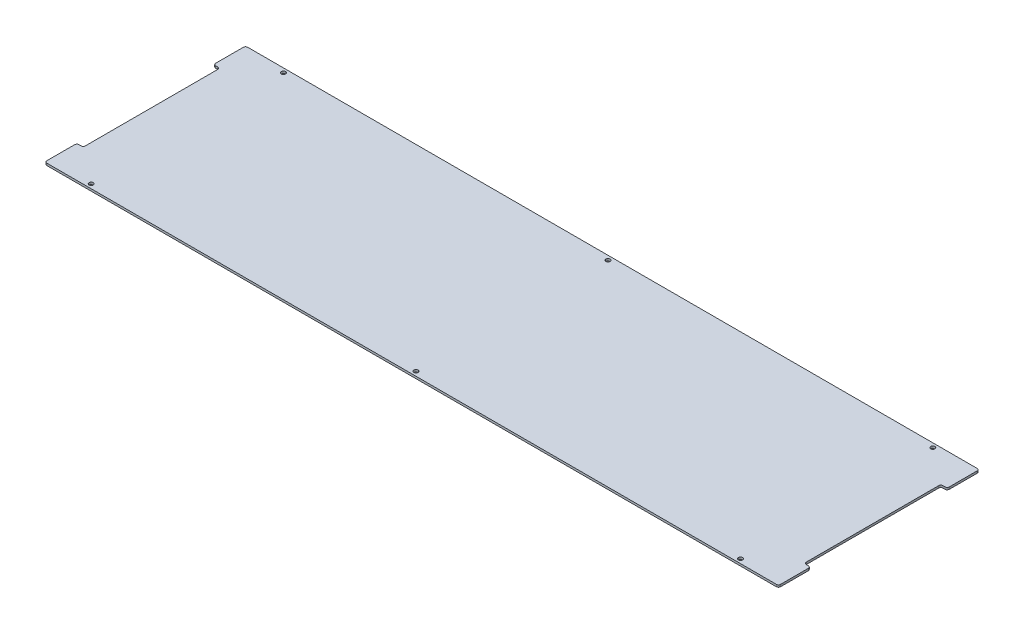
ISO-10303-21;
HEADER;
FILE_DESCRIPTION(('STEP AP214'),'2;1');
FILE_NAME('part.step','',(''),(''),'','','');
FILE_SCHEMA(('AUTOMOTIVE_DESIGN { 1 0 10303 214 1 1 1 1 }'));
ENDSEC;
DATA;
#1=APPLICATION_CONTEXT('core data for automotive mechanical design processes');
#2=APPLICATION_PROTOCOL_DEFINITION('international standard','automotive_design',2000,#1);
#3=PRODUCT_CONTEXT('',#1,'mechanical');
#4=PRODUCT('Part','Part','',(#3));
#5=PRODUCT_RELATED_PRODUCT_CATEGORY('part','',(#4));
#6=PRODUCT_DEFINITION_FORMATION('','',#4);
#7=PRODUCT_DEFINITION_CONTEXT('part definition',#1,'design');
#8=PRODUCT_DEFINITION('design','',#6,#7);
#9=PRODUCT_DEFINITION_SHAPE('','',#8);
#10=(LENGTH_UNIT() NAMED_UNIT(*) SI_UNIT(.MILLI.,.METRE.));
#11=(NAMED_UNIT(*) PLANE_ANGLE_UNIT() SI_UNIT($,.RADIAN.));
#12=(NAMED_UNIT(*) SI_UNIT($,.STERADIAN.) SOLID_ANGLE_UNIT());
#13=UNCERTAINTY_MEASURE_WITH_UNIT(LENGTH_MEASURE(1.E-05),#10,'distance_accuracy_value','');
#14=(GEOMETRIC_REPRESENTATION_CONTEXT(3) GLOBAL_UNCERTAINTY_ASSIGNED_CONTEXT((#13)) GLOBAL_UNIT_ASSIGNED_CONTEXT((#10,
#11,#12)) REPRESENTATION_CONTEXT('',''));
#15=CARTESIAN_POINT('',(0.,0.,0.));
#16=DIRECTION('',(0.,0.,1.));
#17=DIRECTION('',(1.,0.,0.));
#18=AXIS2_PLACEMENT_3D('',#15,#16,#17);
#19=CARTESIAN_POINT('',(0.,3.175,0.));
#20=DIRECTION('',(0.,-1.,0.));
#21=DIRECTION('',(0.,0.,-1.));
#22=AXIS2_PLACEMENT_3D('',#19,#20,#21);
#23=PLANE('',#22);
#24=CARTESIAN_POINT('',(482.6,3.175,142.875));
#25=DIRECTION('',(0.,1.,0.));
#26=DIRECTION('',(0.,0.,1.));
#27=AXIS2_PLACEMENT_3D('',#24,#25,#26);
#28=CIRCLE('',#27,3.17499999999998);
#29=CARTESIAN_POINT('',(482.6,3.175,146.05));
#30=VERTEX_POINT('',#29);
#31=EDGE_CURVE('E941',#30,#30,#28,.T.);
#32=ORIENTED_EDGE('',*,*,#31,.F.);
#33=EDGE_LOOP('',(#32));
#34=FACE_BOUND('',#33,.T.);
#35=CARTESIAN_POINT('',(-482.6,3.175,142.875));
#36=DIRECTION('',(0.,1.,0.));
#37=DIRECTION('',(0.,0.,1.));
#38=AXIS2_PLACEMENT_3D('',#35,#36,#37);
#39=CIRCLE('',#38,3.17499999999998);
#40=CARTESIAN_POINT('',(-482.6,3.175,146.05));
#41=VERTEX_POINT('',#40);
#42=EDGE_CURVE('E925',#41,#41,#39,.T.);
#43=ORIENTED_EDGE('',*,*,#42,.F.);
#44=EDGE_LOOP('',(#43));
#45=FACE_BOUND('',#44,.T.);
#46=CARTESIAN_POINT('',(482.6,3.175,-142.875));
#47=DIRECTION('',(0.,1.,0.));
#48=DIRECTION('',(0.,0.,1.));
#49=AXIS2_PLACEMENT_3D('',#46,#47,#48);
#50=CIRCLE('',#49,3.17499999999998);
#51=CARTESIAN_POINT('',(482.6,3.175,-139.7));
#52=VERTEX_POINT('',#51);
#53=EDGE_CURVE('E917',#52,#52,#50,.T.);
#54=ORIENTED_EDGE('',*,*,#53,.F.);
#55=EDGE_LOOP('',(#54));
#56=FACE_BOUND('',#55,.T.);
#57=CARTESIAN_POINT('',(0.,3.175,-142.875));
#58=DIRECTION('',(0.,1.,0.));
#59=DIRECTION('',(0.,0.,1.));
#60=AXIS2_PLACEMENT_3D('',#57,#58,#59);
#61=CIRCLE('',#60,3.17499999999999);
#62=CARTESIAN_POINT('',(0.,3.175,-139.7));
#63=VERTEX_POINT('',#62);
#64=EDGE_CURVE('E909',#63,#63,#61,.T.);
#65=ORIENTED_EDGE('',*,*,#64,.F.);
#66=EDGE_LOOP('',(#65));
#67=FACE_BOUND('',#66,.T.);
#68=CARTESIAN_POINT('',(-482.6,3.175,-142.875));
#69=DIRECTION('',(0.,1.,0.));
#70=DIRECTION('',(0.,0.,1.));
#71=AXIS2_PLACEMENT_3D('',#68,#69,#70);
#72=CIRCLE('',#71,3.17499999999998);
#73=CARTESIAN_POINT('',(-482.6,3.175,-139.7));
#74=VERTEX_POINT('',#73);
#75=EDGE_CURVE('E901',#74,#74,#72,.T.);
#76=ORIENTED_EDGE('',*,*,#75,.F.);
#77=EDGE_LOOP('',(#76));
#78=FACE_BOUND('',#77,.T.);
#79=DIRECTION('',(0.,0.,1.));
#80=VECTOR('',#79,1.);
#81=CARTESIAN_POINT('',(-545.30625,3.175,149.225));
#82=LINE('',#81,#80);
#83=CARTESIAN_POINT('',(-545.30625,3.175,104.775));
#84=VERTEX_POINT('',#83);
#85=CARTESIAN_POINT('',(-545.30625,3.175,146.05));
#86=VERTEX_POINT('',#85);
#87=EDGE_CURVE('E275',#84,#86,#82,.T.);
#88=ORIENTED_EDGE('',*,*,#87,.T.);
#89=CARTESIAN_POINT('',(-542.13125,3.175,146.05));
#90=DIRECTION('',(0.,-1.,0.));
#91=DIRECTION('',(0.,0.,-1.));
#92=AXIS2_PLACEMENT_3D('',#89,#90,#91);
#93=CIRCLE('',#92,3.175);
#94=CARTESIAN_POINT('',(-542.13125,3.175,149.225));
#95=VERTEX_POINT('',#94);
#96=EDGE_CURVE('E398',#86,#95,#93,.F.);
#97=ORIENTED_EDGE('',*,*,#96,.T.);
#98=DIRECTION('',(1.,0.,0.));
#99=VECTOR('',#98,1.);
#100=CARTESIAN_POINT('',(-545.30625,3.175,149.225));
#101=LINE('',#100,#99);
#102=CARTESIAN_POINT('',(542.13125,3.175,149.225));
#103=VERTEX_POINT('',#102);
#104=EDGE_CURVE('E247',#95,#103,#101,.T.);
#105=ORIENTED_EDGE('',*,*,#104,.T.);
#106=CARTESIAN_POINT('',(542.13125,3.175,146.05));
#107=DIRECTION('',(0.,-1.,0.));
#108=DIRECTION('',(0.,0.,-1.));
#109=AXIS2_PLACEMENT_3D('',#106,#107,#108);
#110=CIRCLE('',#109,3.175);
#111=CARTESIAN_POINT('',(545.30625,3.175,146.05));
#112=VERTEX_POINT('',#111);
#113=EDGE_CURVE('E388',#103,#112,#110,.F.);
#114=ORIENTED_EDGE('',*,*,#113,.T.);
#115=DIRECTION('',(0.,0.,-1.));
#116=VECTOR('',#115,1.);
#117=CARTESIAN_POINT('',(545.30625,3.175,149.225));
#118=LINE('',#117,#116);
#119=CARTESIAN_POINT('',(545.30625,3.175,104.775));
#120=VERTEX_POINT('',#119);
#121=EDGE_CURVE('E270',#112,#120,#118,.T.);
#122=ORIENTED_EDGE('',*,*,#121,.T.);
#123=CARTESIAN_POINT('',(542.13125,3.175,104.775));
#124=DIRECTION('',(0.,-1.,0.));
#125=DIRECTION('',(0.,0.,-1.));
#126=AXIS2_PLACEMENT_3D('',#123,#124,#125);
#127=CIRCLE('',#126,3.175);
#128=CARTESIAN_POINT('',(542.13125,3.175,101.6));
#129=VERTEX_POINT('',#128);
#130=EDGE_CURVE('E252',#120,#129,#127,.F.);
#131=ORIENTED_EDGE('',*,*,#130,.T.);
#132=DIRECTION('',(1.,0.,0.));
#133=VECTOR('',#132,1.);
#134=CARTESIAN_POINT('',(545.30625,3.175,101.6));
#135=LINE('',#134,#133);
#136=CARTESIAN_POINT('',(538.95625,3.175,101.6));
#137=VERTEX_POINT('',#136);
#138=EDGE_CURVE('E241',#137,#129,#135,.T.);
#139=ORIENTED_EDGE('',*,*,#138,.F.);
#140=CARTESIAN_POINT('',(538.95625,3.175,98.425));
#141=DIRECTION('',(0.,-1.,0.));
#142=DIRECTION('',(0.,0.,-1.));
#143=AXIS2_PLACEMENT_3D('',#140,#141,#142);
#144=CIRCLE('',#143,3.175);
#145=CARTESIAN_POINT('',(535.78125,3.175,98.4249999999999));
#146=VERTEX_POINT('',#145);
#147=EDGE_CURVE('E224',#137,#146,#144,.T.);
#148=ORIENTED_EDGE('',*,*,#147,.T.);
#149=DIRECTION('',(0.,0.,1.));
#150=VECTOR('',#149,1.);
#151=CARTESIAN_POINT('',(535.78125,3.175,-101.6));
#152=LINE('',#151,#150);
#153=CARTESIAN_POINT('',(535.78125,3.175,-98.425));
#154=VERTEX_POINT('',#153);
#155=EDGE_CURVE('E255',#154,#146,#152,.T.);
#156=ORIENTED_EDGE('',*,*,#155,.F.);
#157=CARTESIAN_POINT('',(538.95625,3.175,-98.425));
#158=DIRECTION('',(0.,-1.,0.));
#159=DIRECTION('',(0.,0.,-1.));
#160=AXIS2_PLACEMENT_3D('',#157,#158,#159);
#161=CIRCLE('',#160,3.175);
#162=CARTESIAN_POINT('',(538.95625,3.175,-101.6));
#163=VERTEX_POINT('',#162);
#164=EDGE_CURVE('E309',#154,#163,#161,.T.);
#165=ORIENTED_EDGE('',*,*,#164,.T.);
#166=DIRECTION('',(-1.,0.,0.));
#167=VECTOR('',#166,1.);
#168=CARTESIAN_POINT('',(545.30625,3.175,-101.6));
#169=LINE('',#168,#167);
#170=CARTESIAN_POINT('',(542.13125,3.175,-101.6));
#171=VERTEX_POINT('',#170);
#172=EDGE_CURVE('E262',#171,#163,#169,.T.);
#173=ORIENTED_EDGE('',*,*,#172,.F.);
#174=CARTESIAN_POINT('',(542.13125,3.175,-104.775));
#175=DIRECTION('',(0.,-1.,0.));
#176=DIRECTION('',(0.,0.,-1.));
#177=AXIS2_PLACEMENT_3D('',#174,#175,#176);
#178=CIRCLE('',#177,3.175);
#179=CARTESIAN_POINT('',(545.30625,3.175,-104.775));
#180=VERTEX_POINT('',#179);
#181=EDGE_CURVE('E383',#171,#180,#178,.F.);
#182=ORIENTED_EDGE('',*,*,#181,.T.);
#183=CARTESIAN_POINT('',(545.30625,3.175,-146.05));
#184=VERTEX_POINT('',#183);
#185=EDGE_CURVE('E266',#180,#184,#118,.T.);
#186=ORIENTED_EDGE('',*,*,#185,.T.);
#187=CARTESIAN_POINT('',(542.13125,3.175,-146.05));
#188=DIRECTION('',(0.,-1.,0.));
#189=DIRECTION('',(0.,0.,-1.));
#190=AXIS2_PLACEMENT_3D('',#187,#188,#189);
#191=CIRCLE('',#190,3.175);
#192=CARTESIAN_POINT('',(542.13125,3.175,-149.225));
#193=VERTEX_POINT('',#192);
#194=EDGE_CURVE('E380',#184,#193,#191,.F.);
#195=ORIENTED_EDGE('',*,*,#194,.T.);
#196=DIRECTION('',(-1.,0.,0.));
#197=VECTOR('',#196,1.);
#198=CARTESIAN_POINT('',(-545.30625,3.175,-149.225));
#199=LINE('',#198,#197);
#200=CARTESIAN_POINT('',(-542.13125,3.175,-149.225));
#201=VERTEX_POINT('',#200);
#202=EDGE_CURVE('E272',#193,#201,#199,.T.);
#203=ORIENTED_EDGE('',*,*,#202,.T.);
#204=CARTESIAN_POINT('',(-542.13125,3.175,-146.05));
#205=DIRECTION('',(0.,-1.,0.));
#206=DIRECTION('',(0.,0.,-1.));
#207=AXIS2_PLACEMENT_3D('',#204,#205,#206);
#208=CIRCLE('',#207,3.175);
#209=CARTESIAN_POINT('',(-545.30625,3.175,-146.05));
#210=VERTEX_POINT('',#209);
#211=EDGE_CURVE('E84',#201,#210,#208,.F.);
#212=ORIENTED_EDGE('',*,*,#211,.T.);
#213=CARTESIAN_POINT('',(-545.30625,3.175,-104.775));
#214=VERTEX_POINT('',#213);
#215=EDGE_CURVE('E276',#210,#214,#82,.T.);
#216=ORIENTED_EDGE('',*,*,#215,.T.);
#217=CARTESIAN_POINT('',(-542.13125,3.175,-104.775));
#218=DIRECTION('',(0.,-1.,0.));
#219=DIRECTION('',(0.,0.,-1.));
#220=AXIS2_PLACEMENT_3D('',#217,#218,#219);
#221=CIRCLE('',#220,3.175);
#222=CARTESIAN_POINT('',(-542.13125,3.175,-101.6));
#223=VERTEX_POINT('',#222);
#224=EDGE_CURVE('E76',#214,#223,#221,.F.);
#225=ORIENTED_EDGE('',*,*,#224,.T.);
#226=DIRECTION('',(1.,0.,0.));
#227=VECTOR('',#226,1.);
#228=CARTESIAN_POINT('',(-545.30625,3.175,-101.6));
#229=LINE('',#228,#227);
#230=CARTESIAN_POINT('',(-538.95625,3.175,-101.6));
#231=VERTEX_POINT('',#230);
#232=EDGE_CURVE('E466',#223,#231,#229,.T.);
#233=ORIENTED_EDGE('',*,*,#232,.T.);
#234=CARTESIAN_POINT('',(-538.95625,3.175,-98.425));
#235=DIRECTION('',(0.,-1.,0.));
#236=DIRECTION('',(0.,0.,-1.));
#237=AXIS2_PLACEMENT_3D('',#234,#235,#236);
#238=CIRCLE('',#237,3.175);
#239=CARTESIAN_POINT('',(-535.78125,3.175,-98.425));
#240=VERTEX_POINT('',#239);
#241=EDGE_CURVE('E336',#231,#240,#238,.T.);
#242=ORIENTED_EDGE('',*,*,#241,.T.);
#243=DIRECTION('',(0.,0.,1.));
#244=VECTOR('',#243,1.);
#245=CARTESIAN_POINT('',(-535.78125,3.175,-101.6));
#246=LINE('',#245,#244);
#247=CARTESIAN_POINT('',(-535.78125,3.175,98.4249999999999));
#248=VERTEX_POINT('',#247);
#249=EDGE_CURVE('E474',#240,#248,#246,.T.);
#250=ORIENTED_EDGE('',*,*,#249,.T.);
#251=CARTESIAN_POINT('',(-538.95625,3.175,98.425));
#252=DIRECTION('',(0.,-1.,0.));
#253=DIRECTION('',(0.,0.,-1.));
#254=AXIS2_PLACEMENT_3D('',#251,#252,#253);
#255=CIRCLE('',#254,3.175);
#256=CARTESIAN_POINT('',(-538.95625,3.175,101.6));
#257=VERTEX_POINT('',#256);
#258=EDGE_CURVE('E330',#248,#257,#255,.T.);
#259=ORIENTED_EDGE('',*,*,#258,.T.);
#260=DIRECTION('',(-1.,0.,0.));
#261=VECTOR('',#260,1.);
#262=CARTESIAN_POINT('',(-545.30625,3.175,101.6));
#263=LINE('',#262,#261);
#264=CARTESIAN_POINT('',(-542.13125,3.175,101.6));
#265=VERTEX_POINT('',#264);
#266=EDGE_CURVE('E491',#257,#265,#263,.T.);
#267=ORIENTED_EDGE('',*,*,#266,.T.);
#268=CARTESIAN_POINT('',(-542.13125,3.175,104.775));
#269=DIRECTION('',(0.,-1.,0.));
#270=DIRECTION('',(0.,0.,-1.));
#271=AXIS2_PLACEMENT_3D('',#268,#269,#270);
#272=CIRCLE('',#271,3.175);
#273=EDGE_CURVE('E395',#265,#84,#272,.F.);
#274=ORIENTED_EDGE('',*,*,#273,.T.);
#275=EDGE_LOOP('',(#88,#97,#105,#114,#122,#131,#139,#148,#156,#165,#173,#182,#186,#195,#203,
#212,#216,#225,#233,#242,#250,#259,#267,#274));
#276=FACE_BOUND('',#275,.T.);
#277=CARTESIAN_POINT('',(0.,3.175,142.875));
#278=DIRECTION('',(0.,1.,0.));
#279=DIRECTION('',(0.,0.,1.));
#280=AXIS2_PLACEMENT_3D('',#277,#278,#279);
#281=CIRCLE('',#280,3.17499999999999);
#282=CARTESIAN_POINT('',(0.,3.175,146.05));
#283=VERTEX_POINT('',#282);
#284=EDGE_CURVE('E933',#283,#283,#281,.T.);
#285=ORIENTED_EDGE('',*,*,#284,.F.);
#286=EDGE_LOOP('',(#285));
#287=FACE_BOUND('',#286,.T.);
#288=ADVANCED_FACE('F60',(#34,#45,#56,#67,#78,#276,#287),#23,.F.);
#289=CARTESIAN_POINT('',(0.,0.,0.));
#290=DIRECTION('',(0.,-1.,0.));
#291=DIRECTION('',(0.,0.,-1.));
#292=AXIS2_PLACEMENT_3D('',#289,#290,#291);
#293=PLANE('',#292);
#294=CARTESIAN_POINT('',(482.6,0.,142.875));
#295=DIRECTION('',(0.,1.,0.));
#296=DIRECTION('',(0.,0.,1.));
#297=AXIS2_PLACEMENT_3D('',#294,#295,#296);
#298=CIRCLE('',#297,3.17499999999998);
#299=CARTESIAN_POINT('',(482.6,0.,146.05));
#300=VERTEX_POINT('',#299);
#301=EDGE_CURVE('E937',#300,#300,#298,.T.);
#302=ORIENTED_EDGE('',*,*,#301,.T.);
#303=EDGE_LOOP('',(#302));
#304=FACE_BOUND('',#303,.T.);
#305=DIRECTION('',(1.,0.,0.));
#306=VECTOR('',#305,1.);
#307=CARTESIAN_POINT('',(-545.30625,0.,149.225));
#308=LINE('',#307,#306);
#309=CARTESIAN_POINT('',(-542.13125,0.,149.225));
#310=VERTEX_POINT('',#309);
#311=CARTESIAN_POINT('',(542.13125,0.,149.225));
#312=VERTEX_POINT('',#311);
#313=EDGE_CURVE('E271',#310,#312,#308,.T.);
#314=ORIENTED_EDGE('',*,*,#313,.F.);
#315=CARTESIAN_POINT('',(-542.13125,0.,146.05));
#316=DIRECTION('',(0.,-1.,0.));
#317=DIRECTION('',(0.,0.,-1.));
#318=AXIS2_PLACEMENT_3D('',#315,#316,#317);
#319=CIRCLE('',#318,3.175);
#320=CARTESIAN_POINT('',(-545.30625,0.,146.05));
#321=VERTEX_POINT('',#320);
#322=EDGE_CURVE('E371',#310,#321,#319,.T.);
#323=ORIENTED_EDGE('',*,*,#322,.T.);
#324=DIRECTION('',(0.,0.,1.));
#325=VECTOR('',#324,1.);
#326=CARTESIAN_POINT('',(-545.30625,0.,149.225));
#327=LINE('',#326,#325);
#328=CARTESIAN_POINT('',(-545.30625,0.,104.775));
#329=VERTEX_POINT('',#328);
#330=EDGE_CURVE('E291',#329,#321,#327,.T.);
#331=ORIENTED_EDGE('',*,*,#330,.F.);
#332=CARTESIAN_POINT('',(-542.13125,0.,104.775));
#333=DIRECTION('',(0.,-1.,0.));
#334=DIRECTION('',(0.,0.,-1.));
#335=AXIS2_PLACEMENT_3D('',#332,#333,#334);
#336=CIRCLE('',#335,3.175);
#337=CARTESIAN_POINT('',(-542.13125,0.,101.6));
#338=VERTEX_POINT('',#337);
#339=EDGE_CURVE('E368',#329,#338,#336,.T.);
#340=ORIENTED_EDGE('',*,*,#339,.T.);
#341=DIRECTION('',(-1.,0.,0.));
#342=VECTOR('',#341,1.);
#343=CARTESIAN_POINT('',(-545.30625,0.,101.6));
#344=LINE('',#343,#342);
#345=CARTESIAN_POINT('',(-538.95625,0.,101.6));
#346=VERTEX_POINT('',#345);
#347=EDGE_CURVE('E473',#346,#338,#344,.T.);
#348=ORIENTED_EDGE('',*,*,#347,.F.);
#349=CARTESIAN_POINT('',(-538.95625,0.,98.425));
#350=DIRECTION('',(0.,-1.,0.));
#351=DIRECTION('',(0.,0.,-1.));
#352=AXIS2_PLACEMENT_3D('',#349,#350,#351);
#353=CIRCLE('',#352,3.175);
#354=CARTESIAN_POINT('',(-535.78125,0.,98.4249999999999));
#355=VERTEX_POINT('',#354);
#356=EDGE_CURVE('E333',#346,#355,#353,.F.);
#357=ORIENTED_EDGE('',*,*,#356,.T.);
#358=DIRECTION('',(0.,0.,1.));
#359=VECTOR('',#358,1.);
#360=CARTESIAN_POINT('',(-535.78125,0.,-101.6));
#361=LINE('',#360,#359);
#362=CARTESIAN_POINT('',(-535.78125,0.,-98.425));
#363=VERTEX_POINT('',#362);
#364=EDGE_CURVE('E482',#363,#355,#361,.T.);
#365=ORIENTED_EDGE('',*,*,#364,.F.);
#366=CARTESIAN_POINT('',(-538.95625,0.,-98.425));
#367=DIRECTION('',(0.,-1.,0.));
#368=DIRECTION('',(0.,0.,-1.));
#369=AXIS2_PLACEMENT_3D('',#366,#367,#368);
#370=CIRCLE('',#369,3.175);
#371=CARTESIAN_POINT('',(-538.95625,0.,-101.6));
#372=VERTEX_POINT('',#371);
#373=EDGE_CURVE('E339',#363,#372,#370,.F.);
#374=ORIENTED_EDGE('',*,*,#373,.T.);
#375=DIRECTION('',(1.,0.,0.));
#376=VECTOR('',#375,1.);
#377=CARTESIAN_POINT('',(-545.30625,0.,-101.6));
#378=LINE('',#377,#376);
#379=CARTESIAN_POINT('',(-542.13125,0.,-101.6));
#380=VERTEX_POINT('',#379);
#381=EDGE_CURVE('E478',#380,#372,#378,.T.);
#382=ORIENTED_EDGE('',*,*,#381,.F.);
#383=CARTESIAN_POINT('',(-542.13125,0.,-104.775));
#384=DIRECTION('',(0.,-1.,0.));
#385=DIRECTION('',(0.,0.,-1.));
#386=AXIS2_PLACEMENT_3D('',#383,#384,#385);
#387=CIRCLE('',#386,3.175);
#388=CARTESIAN_POINT('',(-545.30625,0.,-104.775));
#389=VERTEX_POINT('',#388);
#390=EDGE_CURVE('E365',#380,#389,#387,.T.);
#391=ORIENTED_EDGE('',*,*,#390,.T.);
#392=CARTESIAN_POINT('',(-545.30625,0.,-146.05));
#393=VERTEX_POINT('',#392);
#394=EDGE_CURVE('E295',#393,#389,#327,.T.);
#395=ORIENTED_EDGE('',*,*,#394,.F.);
#396=CARTESIAN_POINT('',(-542.13125,0.,-146.05));
#397=DIRECTION('',(0.,-1.,0.));
#398=DIRECTION('',(0.,0.,-1.));
#399=AXIS2_PLACEMENT_3D('',#396,#397,#398);
#400=CIRCLE('',#399,3.175);
#401=CARTESIAN_POINT('',(-542.13125,0.,-149.225));
#402=VERTEX_POINT('',#401);
#403=EDGE_CURVE('E362',#393,#402,#400,.T.);
#404=ORIENTED_EDGE('',*,*,#403,.T.);
#405=DIRECTION('',(-1.,0.,0.));
#406=VECTOR('',#405,1.);
#407=CARTESIAN_POINT('',(-545.30625,0.,-149.225));
#408=LINE('',#407,#406);
#409=CARTESIAN_POINT('',(542.13125,0.,-149.225));
#410=VERTEX_POINT('',#409);
#411=EDGE_CURVE('E286',#410,#402,#408,.T.);
#412=ORIENTED_EDGE('',*,*,#411,.F.);
#413=CARTESIAN_POINT('',(542.13125,0.,-146.05));
#414=DIRECTION('',(0.,-1.,0.));
#415=DIRECTION('',(0.,0.,-1.));
#416=AXIS2_PLACEMENT_3D('',#413,#414,#415);
#417=CIRCLE('',#416,3.175);
#418=CARTESIAN_POINT('',(545.30625,0.,-146.05));
#419=VERTEX_POINT('',#418);
#420=EDGE_CURVE('E350',#410,#419,#417,.T.);
#421=ORIENTED_EDGE('',*,*,#420,.T.);
#422=DIRECTION('',(0.,0.,-1.));
#423=VECTOR('',#422,1.);
#424=CARTESIAN_POINT('',(545.30625,0.,149.225));
#425=LINE('',#424,#423);
#426=CARTESIAN_POINT('',(545.30625,0.,-104.775));
#427=VERTEX_POINT('',#426);
#428=EDGE_CURVE('E287',#427,#419,#425,.T.);
#429=ORIENTED_EDGE('',*,*,#428,.F.);
#430=CARTESIAN_POINT('',(542.13125,0.,-104.775));
#431=DIRECTION('',(0.,-1.,0.));
#432=DIRECTION('',(0.,0.,-1.));
#433=AXIS2_PLACEMENT_3D('',#430,#431,#432);
#434=CIRCLE('',#433,3.175);
#435=CARTESIAN_POINT('',(542.13125,0.,-101.6));
#436=VERTEX_POINT('',#435);
#437=EDGE_CURVE('E353',#427,#436,#434,.T.);
#438=ORIENTED_EDGE('',*,*,#437,.T.);
#439=DIRECTION('',(-1.,0.,0.));
#440=VECTOR('',#439,1.);
#441=CARTESIAN_POINT('',(545.30625,0.,-101.6));
#442=LINE('',#441,#440);
#443=CARTESIAN_POINT('',(538.95625,0.,-101.6));
#444=VERTEX_POINT('',#443);
#445=EDGE_CURVE('E254',#436,#444,#442,.T.);
#446=ORIENTED_EDGE('',*,*,#445,.T.);
#447=CARTESIAN_POINT('',(538.95625,0.,-98.425));
#448=DIRECTION('',(0.,-1.,0.));
#449=DIRECTION('',(0.,0.,-1.));
#450=AXIS2_PLACEMENT_3D('',#447,#448,#449);
#451=CIRCLE('',#450,3.175);
#452=CARTESIAN_POINT('',(535.78125,0.,-98.425));
#453=VERTEX_POINT('',#452);
#454=EDGE_CURVE('E313',#444,#453,#451,.F.);
#455=ORIENTED_EDGE('',*,*,#454,.T.);
#456=DIRECTION('',(0.,0.,1.));
#457=VECTOR('',#456,1.);
#458=CARTESIAN_POINT('',(535.78125,0.,-101.6));
#459=LINE('',#458,#457);
#460=CARTESIAN_POINT('',(535.78125,0.,98.4249999999999));
#461=VERTEX_POINT('',#460);
#462=EDGE_CURVE('E260',#453,#461,#459,.T.);
#463=ORIENTED_EDGE('',*,*,#462,.T.);
#464=CARTESIAN_POINT('',(538.95625,0.,98.425));
#465=DIRECTION('',(0.,-1.,0.));
#466=DIRECTION('',(0.,0.,-1.));
#467=AXIS2_PLACEMENT_3D('',#464,#465,#466);
#468=CIRCLE('',#467,3.175);
#469=CARTESIAN_POINT('',(538.95625,0.,101.6));
#470=VERTEX_POINT('',#469);
#471=EDGE_CURVE('E234',#461,#470,#468,.F.);
#472=ORIENTED_EDGE('',*,*,#471,.T.);
#473=DIRECTION('',(1.,0.,0.));
#474=VECTOR('',#473,1.);
#475=CARTESIAN_POINT('',(545.30625,0.,101.6));
#476=LINE('',#475,#474);
#477=CARTESIAN_POINT('',(542.13125,0.,101.6));
#478=VERTEX_POINT('',#477);
#479=EDGE_CURVE('E244',#470,#478,#476,.T.);
#480=ORIENTED_EDGE('',*,*,#479,.T.);
#481=CARTESIAN_POINT('',(542.13125,0.,104.775));
#482=DIRECTION('',(0.,-1.,0.));
#483=DIRECTION('',(0.,0.,-1.));
#484=AXIS2_PLACEMENT_3D('',#481,#482,#483);
#485=CIRCLE('',#484,3.175);
#486=CARTESIAN_POINT('',(545.30625,0.,104.775));
#487=VERTEX_POINT('',#486);
#488=EDGE_CURVE('E356',#478,#487,#485,.T.);
#489=ORIENTED_EDGE('',*,*,#488,.T.);
#490=CARTESIAN_POINT('',(545.30625,0.,146.05));
#491=VERTEX_POINT('',#490);
#492=EDGE_CURVE('E282',#491,#487,#425,.T.);
#493=ORIENTED_EDGE('',*,*,#492,.F.);
#494=CARTESIAN_POINT('',(542.13125,0.,146.05));
#495=DIRECTION('',(0.,-1.,0.));
#496=DIRECTION('',(0.,0.,-1.));
#497=AXIS2_PLACEMENT_3D('',#494,#495,#496);
#498=CIRCLE('',#497,3.175);
#499=EDGE_CURVE('E359',#491,#312,#498,.T.);
#500=ORIENTED_EDGE('',*,*,#499,.T.);
#501=EDGE_LOOP('',(#314,#323,#331,#340,#348,#357,#365,#374,#382,#391,#395,#404,#412,#421,#429,
#438,#446,#455,#463,#472,#480,#489,#493,#500));
#502=FACE_BOUND('',#501,.T.);
#503=CARTESIAN_POINT('',(-482.6,0.,-142.875));
#504=DIRECTION('',(0.,1.,0.));
#505=DIRECTION('',(0.,0.,1.));
#506=AXIS2_PLACEMENT_3D('',#503,#504,#505);
#507=CIRCLE('',#506,3.17499999999998);
#508=CARTESIAN_POINT('',(-482.6,0.,-139.7));
#509=VERTEX_POINT('',#508);
#510=EDGE_CURVE('E495',#509,#509,#507,.T.);
#511=ORIENTED_EDGE('',*,*,#510,.T.);
#512=EDGE_LOOP('',(#511));
#513=FACE_BOUND('',#512,.T.);
#514=CARTESIAN_POINT('',(0.,0.,-142.875));
#515=DIRECTION('',(0.,1.,0.));
#516=DIRECTION('',(0.,0.,1.));
#517=AXIS2_PLACEMENT_3D('',#514,#515,#516);
#518=CIRCLE('',#517,3.175);
#519=CARTESIAN_POINT('',(0.,0.,-139.7));
#520=VERTEX_POINT('',#519);
#521=EDGE_CURVE('E905',#520,#520,#518,.T.);
#522=ORIENTED_EDGE('',*,*,#521,.T.);
#523=EDGE_LOOP('',(#522));
#524=FACE_BOUND('',#523,.T.);
#525=CARTESIAN_POINT('',(482.6,0.,-142.875));
#526=DIRECTION('',(0.,1.,0.));
#527=DIRECTION('',(0.,0.,1.));
#528=AXIS2_PLACEMENT_3D('',#525,#526,#527);
#529=CIRCLE('',#528,3.17499999999998);
#530=CARTESIAN_POINT('',(482.6,0.,-139.7));
#531=VERTEX_POINT('',#530);
#532=EDGE_CURVE('E913',#531,#531,#529,.T.);
#533=ORIENTED_EDGE('',*,*,#532,.T.);
#534=EDGE_LOOP('',(#533));
#535=FACE_BOUND('',#534,.T.);
#536=CARTESIAN_POINT('',(-482.6,0.,142.875));
#537=DIRECTION('',(0.,1.,0.));
#538=DIRECTION('',(0.,0.,1.));
#539=AXIS2_PLACEMENT_3D('',#536,#537,#538);
#540=CIRCLE('',#539,3.17499999999998);
#541=CARTESIAN_POINT('',(-482.6,0.,146.05));
#542=VERTEX_POINT('',#541);
#543=EDGE_CURVE('E921',#542,#542,#540,.T.);
#544=ORIENTED_EDGE('',*,*,#543,.T.);
#545=EDGE_LOOP('',(#544));
#546=FACE_BOUND('',#545,.T.);
#547=CARTESIAN_POINT('',(0.,0.,142.875));
#548=DIRECTION('',(0.,1.,0.));
#549=DIRECTION('',(0.,0.,1.));
#550=AXIS2_PLACEMENT_3D('',#547,#548,#549);
#551=CIRCLE('',#550,3.175);
#552=CARTESIAN_POINT('',(0.,0.,146.05));
#553=VERTEX_POINT('',#552);
#554=EDGE_CURVE('E929',#553,#553,#551,.T.);
#555=ORIENTED_EDGE('',*,*,#554,.T.);
#556=EDGE_LOOP('',(#555));
#557=FACE_BOUND('',#556,.T.);
#558=ADVANCED_FACE('F456',(#304,#502,#513,#524,#535,#546,#557),#293,.T.);
#559=CARTESIAN_POINT('',(-545.30625,3.175,149.225));
#560=DIRECTION('',(1.,0.,0.));
#561=DIRECTION('',(0.,0.,-1.));
#562=AXIS2_PLACEMENT_3D('',#559,#560,#561);
#563=PLANE('',#562);
#564=ORIENTED_EDGE('',*,*,#394,.T.);
#565=DIRECTION('',(0.,1.,0.));
#566=VECTOR('',#565,1.);
#567=CARTESIAN_POINT('',(-545.30625,3.175,-104.775));
#568=LINE('',#567,#566);
#569=EDGE_CURVE('E409',#389,#214,#568,.T.);
#570=ORIENTED_EDGE('',*,*,#569,.T.);
#571=ORIENTED_EDGE('',*,*,#215,.F.);
#572=DIRECTION('',(0.,-1.,0.));
#573=VECTOR('',#572,1.);
#574=CARTESIAN_POINT('',(-545.30625,3.175,-146.05));
#575=LINE('',#574,#573);
#576=EDGE_CURVE('E405',#210,#393,#575,.T.);
#577=ORIENTED_EDGE('',*,*,#576,.T.);
#578=EDGE_LOOP('',(#564,#570,#571,#577));
#579=FACE_BOUND('',#578,.T.);
#580=ADVANCED_FACE('F464',(#579),#563,.F.);
#581=ORIENTED_EDGE('',*,*,#330,.T.);
#582=DIRECTION('',(0.,-1.,0.));
#583=VECTOR('',#582,1.);
#584=CARTESIAN_POINT('',(-545.30625,3.175,146.05));
#585=LINE('',#584,#583);
#586=EDGE_CURVE('E377',#321,#86,#585,.F.);
#587=ORIENTED_EDGE('',*,*,#586,.T.);
#588=ORIENTED_EDGE('',*,*,#87,.F.);
#589=DIRECTION('',(0.,1.,0.));
#590=VECTOR('',#589,1.);
#591=CARTESIAN_POINT('',(-545.30625,0.,104.775));
#592=LINE('',#591,#590);
#593=EDGE_CURVE('E374',#84,#329,#592,.F.);
#594=ORIENTED_EDGE('',*,*,#593,.T.);
#595=EDGE_LOOP('',(#581,#587,#588,#594));
#596=FACE_BOUND('',#595,.T.);
#597=ADVANCED_FACE('F618',(#596),#563,.F.);
#598=CARTESIAN_POINT('',(545.30625,3.175,149.225));
#599=DIRECTION('',(-1.,0.,0.));
#600=DIRECTION('',(0.,0.,1.));
#601=AXIS2_PLACEMENT_3D('',#598,#599,#600);
#602=PLANE('',#601);
#603=ORIENTED_EDGE('',*,*,#121,.F.);
#604=DIRECTION('',(0.,-1.,0.));
#605=VECTOR('',#604,1.);
#606=CARTESIAN_POINT('',(545.30625,3.175,146.05));
#607=LINE('',#606,#605);
#608=EDGE_CURVE('E426',#112,#491,#607,.T.);
#609=ORIENTED_EDGE('',*,*,#608,.T.);
#610=ORIENTED_EDGE('',*,*,#492,.T.);
#611=DIRECTION('',(0.,1.,0.));
#612=VECTOR('',#611,1.);
#613=CARTESIAN_POINT('',(545.30625,3.175,104.775));
#614=LINE('',#613,#612);
#615=EDGE_CURVE('E422',#487,#120,#614,.T.);
#616=ORIENTED_EDGE('',*,*,#615,.T.);
#617=EDGE_LOOP('',(#603,#609,#610,#616));
#618=FACE_BOUND('',#617,.T.);
#619=ADVANCED_FACE('F587',(#618),#602,.F.);
#620=ORIENTED_EDGE('',*,*,#185,.F.);
#621=DIRECTION('',(0.,1.,0.));
#622=VECTOR('',#621,1.);
#623=CARTESIAN_POINT('',(545.30625,3.175,-104.775));
#624=LINE('',#623,#622);
#625=EDGE_CURVE('E12',#180,#427,#624,.F.);
#626=ORIENTED_EDGE('',*,*,#625,.T.);
#627=ORIENTED_EDGE('',*,*,#428,.T.);
#628=DIRECTION('',(0.,-1.,0.));
#629=VECTOR('',#628,1.);
#630=CARTESIAN_POINT('',(545.30625,3.175,-146.05));
#631=LINE('',#630,#629);
#632=EDGE_CURVE('E69',#419,#184,#631,.F.);
#633=ORIENTED_EDGE('',*,*,#632,.T.);
#634=EDGE_LOOP('',(#620,#626,#627,#633));
#635=FACE_BOUND('',#634,.T.);
#636=ADVANCED_FACE('F442',(#635),#602,.F.);
#637=CARTESIAN_POINT('',(-545.30625,3.175,-149.225));
#638=DIRECTION('',(0.,0.,1.));
#639=DIRECTION('',(1.,0.,0.));
#640=AXIS2_PLACEMENT_3D('',#637,#638,#639);
#641=PLANE('',#640);
#642=ORIENTED_EDGE('',*,*,#411,.T.);
#643=DIRECTION('',(0.,-1.,0.));
#644=VECTOR('',#643,1.);
#645=CARTESIAN_POINT('',(-542.13125,3.175,-149.225));
#646=LINE('',#645,#644);
#647=EDGE_CURVE('E419',#402,#201,#646,.F.);
#648=ORIENTED_EDGE('',*,*,#647,.T.);
#649=ORIENTED_EDGE('',*,*,#202,.F.);
#650=DIRECTION('',(0.,-1.,0.));
#651=VECTOR('',#650,1.);
#652=CARTESIAN_POINT('',(542.13125,3.175,-149.225));
#653=LINE('',#652,#651);
#654=EDGE_CURVE('E415',#193,#410,#653,.T.);
#655=ORIENTED_EDGE('',*,*,#654,.T.);
#656=EDGE_LOOP('',(#642,#648,#649,#655));
#657=FACE_BOUND('',#656,.T.);
#658=ADVANCED_FACE('F452',(#657),#641,.F.);
#659=CARTESIAN_POINT('',(-545.30625,3.175,149.225));
#660=DIRECTION('',(0.,0.,-1.));
#661=DIRECTION('',(-1.,0.,0.));
#662=AXIS2_PLACEMENT_3D('',#659,#660,#661);
#663=PLANE('',#662);
#664=ORIENTED_EDGE('',*,*,#104,.F.);
#665=DIRECTION('',(0.,-1.,0.));
#666=VECTOR('',#665,1.);
#667=CARTESIAN_POINT('',(-542.13125,3.175,149.225));
#668=LINE('',#667,#666);
#669=EDGE_CURVE('E346',#95,#310,#668,.T.);
#670=ORIENTED_EDGE('',*,*,#669,.T.);
#671=ORIENTED_EDGE('',*,*,#313,.T.);
#672=DIRECTION('',(0.,-1.,0.));
#673=VECTOR('',#672,1.);
#674=CARTESIAN_POINT('',(542.13125,3.175,149.225));
#675=LINE('',#674,#673);
#676=EDGE_CURVE('E343',#312,#103,#675,.F.);
#677=ORIENTED_EDGE('',*,*,#676,.T.);
#678=EDGE_LOOP('',(#664,#670,#671,#677));
#679=FACE_BOUND('',#678,.T.);
#680=ADVANCED_FACE('F577',(#679),#663,.F.);
#681=CARTESIAN_POINT('',(545.30625,0.,101.6));
#682=DIRECTION('',(0.,0.,1.));
#683=DIRECTION('',(1.,0.,0.));
#684=AXIS2_PLACEMENT_3D('',#681,#682,#683);
#685=PLANE('',#684);
#686=ORIENTED_EDGE('',*,*,#138,.T.);
#687=DIRECTION('',(0.,1.,0.));
#688=VECTOR('',#687,1.);
#689=CARTESIAN_POINT('',(542.13125,0.,101.6));
#690=LINE('',#689,#688);
#691=EDGE_CURVE('E430',#129,#478,#690,.F.);
#692=ORIENTED_EDGE('',*,*,#691,.T.);
#693=ORIENTED_EDGE('',*,*,#479,.F.);
#694=DIRECTION('',(0.,1.,0.));
#695=VECTOR('',#694,1.);
#696=CARTESIAN_POINT('',(538.95625,3.175,101.6));
#697=LINE('',#696,#695);
#698=EDGE_CURVE('E228',#470,#137,#697,.T.);
#699=ORIENTED_EDGE('',*,*,#698,.T.);
#700=EDGE_LOOP('',(#686,#692,#693,#699));
#701=FACE_BOUND('',#700,.T.);
#702=ADVANCED_FACE('F240',(#701),#685,.F.);
#703=CARTESIAN_POINT('',(535.78125,0.,-101.6));
#704=DIRECTION('',(-1.,0.,0.));
#705=DIRECTION('',(0.,0.,1.));
#706=AXIS2_PLACEMENT_3D('',#703,#704,#705);
#707=PLANE('',#706);
#708=ORIENTED_EDGE('',*,*,#155,.T.);
#709=DIRECTION('',(0.,1.,0.));
#710=VECTOR('',#709,1.);
#711=CARTESIAN_POINT('',(535.78125,0.,98.425));
#712=LINE('',#711,#710);
#713=EDGE_CURVE('E229',#146,#461,#712,.F.);
#714=ORIENTED_EDGE('',*,*,#713,.T.);
#715=ORIENTED_EDGE('',*,*,#462,.F.);
#716=DIRECTION('',(0.,1.,0.));
#717=VECTOR('',#716,1.);
#718=CARTESIAN_POINT('',(535.78125,3.175,-98.425));
#719=LINE('',#718,#717);
#720=EDGE_CURVE('E246',#453,#154,#719,.T.);
#721=ORIENTED_EDGE('',*,*,#720,.T.);
#722=EDGE_LOOP('',(#708,#714,#715,#721));
#723=FACE_BOUND('',#722,.T.);
#724=ADVANCED_FACE('F818',(#723),#707,.F.);
#725=CARTESIAN_POINT('',(545.30625,0.,-101.6));
#726=DIRECTION('',(0.,0.,-1.));
#727=DIRECTION('',(-1.,0.,0.));
#728=AXIS2_PLACEMENT_3D('',#725,#726,#727);
#729=PLANE('',#728);
#730=ORIENTED_EDGE('',*,*,#445,.F.);
#731=DIRECTION('',(0.,1.,0.));
#732=VECTOR('',#731,1.);
#733=CARTESIAN_POINT('',(542.13125,0.,-101.6));
#734=LINE('',#733,#732);
#735=EDGE_CURVE('E433',#436,#171,#734,.T.);
#736=ORIENTED_EDGE('',*,*,#735,.T.);
#737=ORIENTED_EDGE('',*,*,#172,.T.);
#738=DIRECTION('',(0.,1.,0.));
#739=VECTOR('',#738,1.);
#740=CARTESIAN_POINT('',(538.95625,0.,-101.6));
#741=LINE('',#740,#739);
#742=EDGE_CURVE('E235',#163,#444,#741,.F.);
#743=ORIENTED_EDGE('',*,*,#742,.T.);
#744=EDGE_LOOP('',(#730,#736,#737,#743));
#745=FACE_BOUND('',#744,.T.);
#746=ADVANCED_FACE('F611',(#745),#729,.F.);
#747=CARTESIAN_POINT('',(538.95625,0.,98.425));
#748=DIRECTION('',(0.,-1.,0.));
#749=DIRECTION('',(0.,0.,-1.));
#750=AXIS2_PLACEMENT_3D('',#747,#748,#749);
#751=CYLINDRICAL_SURFACE('',#750,3.175);
#752=ORIENTED_EDGE('',*,*,#471,.F.);
#753=ORIENTED_EDGE('',*,*,#713,.F.);
#754=ORIENTED_EDGE('',*,*,#147,.F.);
#755=ORIENTED_EDGE('',*,*,#698,.F.);
#756=EDGE_LOOP('',(#752,#753,#754,#755));
#757=FACE_BOUND('',#756,.T.);
#758=ADVANCED_FACE('F227',(#757),#751,.F.);
#759=CARTESIAN_POINT('',(538.95625,0.,-98.425));
#760=DIRECTION('',(0.,-1.,0.));
#761=DIRECTION('',(0.,0.,-1.));
#762=AXIS2_PLACEMENT_3D('',#759,#760,#761);
#763=CYLINDRICAL_SURFACE('',#762,3.175);
#764=ORIENTED_EDGE('',*,*,#454,.F.);
#765=ORIENTED_EDGE('',*,*,#742,.F.);
#766=ORIENTED_EDGE('',*,*,#164,.F.);
#767=ORIENTED_EDGE('',*,*,#720,.F.);
#768=EDGE_LOOP('',(#764,#765,#766,#767));
#769=FACE_BOUND('',#768,.T.);
#770=ADVANCED_FACE('F625',(#769),#763,.F.);
#771=CARTESIAN_POINT('',(-545.30625,0.,-101.6));
#772=DIRECTION('',(0.,0.,1.));
#773=DIRECTION('',(1.,0.,0.));
#774=AXIS2_PLACEMENT_3D('',#771,#772,#773);
#775=PLANE('',#774);
#776=ORIENTED_EDGE('',*,*,#232,.F.);
#777=DIRECTION('',(0.,1.,0.));
#778=VECTOR('',#777,1.);
#779=CARTESIAN_POINT('',(-542.13125,0.,-101.6));
#780=LINE('',#779,#778);
#781=EDGE_CURVE('E412',#223,#380,#780,.F.);
#782=ORIENTED_EDGE('',*,*,#781,.T.);
#783=ORIENTED_EDGE('',*,*,#381,.T.);
#784=DIRECTION('',(0.,1.,0.));
#785=VECTOR('',#784,1.);
#786=CARTESIAN_POINT('',(-538.95625,3.175,-101.6));
#787=LINE('',#786,#785);
#788=EDGE_CURVE('E326',#372,#231,#787,.T.);
#789=ORIENTED_EDGE('',*,*,#788,.T.);
#790=EDGE_LOOP('',(#776,#782,#783,#789));
#791=FACE_BOUND('',#790,.T.);
#792=ADVANCED_FACE('F469',(#791),#775,.T.);
#793=CARTESIAN_POINT('',(-535.78125,0.,-101.6));
#794=DIRECTION('',(-1.,0.,0.));
#795=DIRECTION('',(0.,0.,1.));
#796=AXIS2_PLACEMENT_3D('',#793,#794,#795);
#797=PLANE('',#796);
#798=ORIENTED_EDGE('',*,*,#364,.T.);
#799=DIRECTION('',(0.,1.,0.));
#800=VECTOR('',#799,1.);
#801=CARTESIAN_POINT('',(-535.78125,3.175,98.425));
#802=LINE('',#801,#800);
#803=EDGE_CURVE('E319',#355,#248,#802,.T.);
#804=ORIENTED_EDGE('',*,*,#803,.T.);
#805=ORIENTED_EDGE('',*,*,#249,.F.);
#806=DIRECTION('',(0.,1.,0.));
#807=VECTOR('',#806,1.);
#808=CARTESIAN_POINT('',(-535.78125,0.,-98.425));
#809=LINE('',#808,#807);
#810=EDGE_CURVE('E316',#240,#363,#809,.F.);
#811=ORIENTED_EDGE('',*,*,#810,.T.);
#812=EDGE_LOOP('',(#798,#804,#805,#811));
#813=FACE_BOUND('',#812,.T.);
#814=ADVANCED_FACE('F773',(#813),#797,.T.);
#815=CARTESIAN_POINT('',(-545.30625,0.,101.6));
#816=DIRECTION('',(0.,0.,-1.));
#817=DIRECTION('',(-1.,0.,0.));
#818=AXIS2_PLACEMENT_3D('',#815,#816,#817);
#819=PLANE('',#818);
#820=ORIENTED_EDGE('',*,*,#347,.T.);
#821=DIRECTION('',(0.,1.,0.));
#822=VECTOR('',#821,1.);
#823=CARTESIAN_POINT('',(-542.13125,3.175,101.6));
#824=LINE('',#823,#822);
#825=EDGE_CURVE('E401',#338,#265,#824,.T.);
#826=ORIENTED_EDGE('',*,*,#825,.T.);
#827=ORIENTED_EDGE('',*,*,#266,.F.);
#828=DIRECTION('',(0.,1.,0.));
#829=VECTOR('',#828,1.);
#830=CARTESIAN_POINT('',(-538.95625,0.,101.6));
#831=LINE('',#830,#829);
#832=EDGE_CURVE('E323',#257,#346,#831,.F.);
#833=ORIENTED_EDGE('',*,*,#832,.T.);
#834=EDGE_LOOP('',(#820,#826,#827,#833));
#835=FACE_BOUND('',#834,.T.);
#836=ADVANCED_FACE('F633',(#835),#819,.T.);
#837=CARTESIAN_POINT('',(-538.95625,0.,98.425));
#838=DIRECTION('',(0.,-1.,0.));
#839=DIRECTION('',(0.,0.,-1.));
#840=AXIS2_PLACEMENT_3D('',#837,#838,#839);
#841=CYLINDRICAL_SURFACE('',#840,3.175);
#842=ORIENTED_EDGE('',*,*,#356,.F.);
#843=ORIENTED_EDGE('',*,*,#832,.F.);
#844=ORIENTED_EDGE('',*,*,#258,.F.);
#845=ORIENTED_EDGE('',*,*,#803,.F.);
#846=EDGE_LOOP('',(#842,#843,#844,#845));
#847=FACE_BOUND('',#846,.T.);
#848=ADVANCED_FACE('F629',(#847),#841,.F.);
#849=CARTESIAN_POINT('',(-538.95625,0.,-98.425));
#850=DIRECTION('',(0.,-1.,0.));
#851=DIRECTION('',(0.,0.,-1.));
#852=AXIS2_PLACEMENT_3D('',#849,#850,#851);
#853=CYLINDRICAL_SURFACE('',#852,3.175);
#854=ORIENTED_EDGE('',*,*,#373,.F.);
#855=ORIENTED_EDGE('',*,*,#810,.F.);
#856=ORIENTED_EDGE('',*,*,#241,.F.);
#857=ORIENTED_EDGE('',*,*,#788,.F.);
#858=EDGE_LOOP('',(#854,#855,#856,#857));
#859=FACE_BOUND('',#858,.T.);
#860=ADVANCED_FACE('F632',(#859),#853,.F.);
#861=CARTESIAN_POINT('',(-482.6,3.175,-142.875));
#862=DIRECTION('',(0.,1.,0.));
#863=DIRECTION('',(0.,0.,1.));
#864=AXIS2_PLACEMENT_3D('',#861,#862,#863);
#865=CYLINDRICAL_SURFACE('',#864,3.17499999999998);
#866=ORIENTED_EDGE('',*,*,#510,.F.);
#867=EDGE_LOOP('',(#866));
#868=FACE_BOUND('',#867,.T.);
#869=ORIENTED_EDGE('',*,*,#75,.T.);
#870=EDGE_LOOP('',(#869));
#871=FACE_BOUND('',#870,.T.);
#872=ADVANCED_FACE('F637',(#868,#871),#865,.F.);
#873=CARTESIAN_POINT('',(0.,3.175,-142.875));
#874=DIRECTION('',(0.,1.,0.));
#875=DIRECTION('',(0.,0.,1.));
#876=AXIS2_PLACEMENT_3D('',#873,#874,#875);
#877=CYLINDRICAL_SURFACE('',#876,3.17499999999999);
#878=ORIENTED_EDGE('',*,*,#521,.F.);
#879=EDGE_LOOP('',(#878));
#880=FACE_BOUND('',#879,.T.);
#881=ORIENTED_EDGE('',*,*,#64,.T.);
#882=EDGE_LOOP('',(#881));
#883=FACE_BOUND('',#882,.T.);
#884=ADVANCED_FACE('F738',(#880,#883),#877,.F.);
#885=CARTESIAN_POINT('',(482.6,3.175,-142.875));
#886=DIRECTION('',(0.,1.,0.));
#887=DIRECTION('',(0.,0.,1.));
#888=AXIS2_PLACEMENT_3D('',#885,#886,#887);
#889=CYLINDRICAL_SURFACE('',#888,3.17499999999998);
#890=ORIENTED_EDGE('',*,*,#532,.F.);
#891=EDGE_LOOP('',(#890));
#892=FACE_BOUND('',#891,.T.);
#893=ORIENTED_EDGE('',*,*,#53,.T.);
#894=EDGE_LOOP('',(#893));
#895=FACE_BOUND('',#894,.T.);
#896=ADVANCED_FACE('F719',(#892,#895),#889,.F.);
#897=CARTESIAN_POINT('',(-482.6,3.175,142.875));
#898=DIRECTION('',(0.,1.,0.));
#899=DIRECTION('',(0.,0.,1.));
#900=AXIS2_PLACEMENT_3D('',#897,#898,#899);
#901=CYLINDRICAL_SURFACE('',#900,3.17499999999998);
#902=ORIENTED_EDGE('',*,*,#543,.F.);
#903=EDGE_LOOP('',(#902));
#904=FACE_BOUND('',#903,.T.);
#905=ORIENTED_EDGE('',*,*,#42,.T.);
#906=EDGE_LOOP('',(#905));
#907=FACE_BOUND('',#906,.T.);
#908=ADVANCED_FACE('F710',(#904,#907),#901,.F.);
#909=CARTESIAN_POINT('',(0.,3.175,142.875));
#910=DIRECTION('',(0.,1.,0.));
#911=DIRECTION('',(0.,0.,1.));
#912=AXIS2_PLACEMENT_3D('',#909,#910,#911);
#913=CYLINDRICAL_SURFACE('',#912,3.17499999999999);
#914=ORIENTED_EDGE('',*,*,#554,.F.);
#915=EDGE_LOOP('',(#914));
#916=FACE_BOUND('',#915,.T.);
#917=ORIENTED_EDGE('',*,*,#284,.T.);
#918=EDGE_LOOP('',(#917));
#919=FACE_BOUND('',#918,.T.);
#920=ADVANCED_FACE('F701',(#916,#919),#913,.F.);
#921=CARTESIAN_POINT('',(482.6,3.175,142.875));
#922=DIRECTION('',(0.,1.,0.));
#923=DIRECTION('',(0.,0.,1.));
#924=AXIS2_PLACEMENT_3D('',#921,#922,#923);
#925=CYLINDRICAL_SURFACE('',#924,3.17499999999998);
#926=ORIENTED_EDGE('',*,*,#301,.F.);
#927=EDGE_LOOP('',(#926));
#928=FACE_BOUND('',#927,.T.);
#929=ORIENTED_EDGE('',*,*,#31,.T.);
#930=EDGE_LOOP('',(#929));
#931=FACE_BOUND('',#930,.T.);
#932=ADVANCED_FACE('F642',(#928,#931),#925,.F.);
#933=CARTESIAN_POINT('',(-542.13125,3.175,146.05));
#934=DIRECTION('',(0.,-1.,0.));
#935=DIRECTION('',(0.,0.,-1.));
#936=AXIS2_PLACEMENT_3D('',#933,#934,#935);
#937=CYLINDRICAL_SURFACE('',#936,3.175);
#938=ORIENTED_EDGE('',*,*,#96,.F.);
#939=ORIENTED_EDGE('',*,*,#586,.F.);
#940=ORIENTED_EDGE('',*,*,#322,.F.);
#941=ORIENTED_EDGE('',*,*,#669,.F.);
#942=EDGE_LOOP('',(#938,#939,#940,#941));
#943=FACE_BOUND('',#942,.T.);
#944=ADVANCED_FACE('F575',(#943),#937,.T.);
#945=CARTESIAN_POINT('',(-542.13125,0.,104.775));
#946=DIRECTION('',(0.,-1.,0.));
#947=DIRECTION('',(0.,0.,-1.));
#948=AXIS2_PLACEMENT_3D('',#945,#946,#947);
#949=CYLINDRICAL_SURFACE('',#948,3.175);
#950=ORIENTED_EDGE('',*,*,#339,.F.);
#951=ORIENTED_EDGE('',*,*,#593,.F.);
#952=ORIENTED_EDGE('',*,*,#273,.F.);
#953=ORIENTED_EDGE('',*,*,#825,.F.);
#954=EDGE_LOOP('',(#950,#951,#952,#953));
#955=FACE_BOUND('',#954,.T.);
#956=ADVANCED_FACE('F641',(#955),#949,.T.);
#957=CARTESIAN_POINT('',(-542.13125,3.175,-104.775));
#958=DIRECTION('',(0.,-1.,0.));
#959=DIRECTION('',(0.,0.,-1.));
#960=AXIS2_PLACEMENT_3D('',#957,#958,#959);
#961=CYLINDRICAL_SURFACE('',#960,3.175);
#962=ORIENTED_EDGE('',*,*,#390,.F.);
#963=ORIENTED_EDGE('',*,*,#781,.F.);
#964=ORIENTED_EDGE('',*,*,#224,.F.);
#965=ORIENTED_EDGE('',*,*,#569,.F.);
#966=EDGE_LOOP('',(#962,#963,#964,#965));
#967=FACE_BOUND('',#966,.T.);
#968=ADVANCED_FACE('F477',(#967),#961,.T.);
#969=CARTESIAN_POINT('',(-542.13125,3.175,-146.05));
#970=DIRECTION('',(0.,-1.,0.));
#971=DIRECTION('',(0.,0.,-1.));
#972=AXIS2_PLACEMENT_3D('',#969,#970,#971);
#973=CYLINDRICAL_SURFACE('',#972,3.175);
#974=ORIENTED_EDGE('',*,*,#211,.F.);
#975=ORIENTED_EDGE('',*,*,#647,.F.);
#976=ORIENTED_EDGE('',*,*,#403,.F.);
#977=ORIENTED_EDGE('',*,*,#576,.F.);
#978=EDGE_LOOP('',(#974,#975,#976,#977));
#979=FACE_BOUND('',#978,.T.);
#980=ADVANCED_FACE('F462',(#979),#973,.T.);
#981=CARTESIAN_POINT('',(542.13125,3.175,146.05));
#982=DIRECTION('',(0.,-1.,0.));
#983=DIRECTION('',(0.,0.,-1.));
#984=AXIS2_PLACEMENT_3D('',#981,#982,#983);
#985=CYLINDRICAL_SURFACE('',#984,3.175);
#986=ORIENTED_EDGE('',*,*,#113,.F.);
#987=ORIENTED_EDGE('',*,*,#676,.F.);
#988=ORIENTED_EDGE('',*,*,#499,.F.);
#989=ORIENTED_EDGE('',*,*,#608,.F.);
#990=EDGE_LOOP('',(#986,#987,#988,#989));
#991=FACE_BOUND('',#990,.T.);
#992=ADVANCED_FACE('F584',(#991),#985,.T.);
#993=CARTESIAN_POINT('',(542.13125,3.175,104.775));
#994=DIRECTION('',(0.,1.,0.));
#995=DIRECTION('',(0.,0.,1.));
#996=AXIS2_PLACEMENT_3D('',#993,#994,#995);
#997=CYLINDRICAL_SURFACE('',#996,3.175);
#998=ORIENTED_EDGE('',*,*,#488,.F.);
#999=ORIENTED_EDGE('',*,*,#691,.F.);
#1000=ORIENTED_EDGE('',*,*,#130,.F.);
#1001=ORIENTED_EDGE('',*,*,#615,.F.);
#1002=EDGE_LOOP('',(#998,#999,#1000,#1001));
#1003=FACE_BOUND('',#1002,.T.);
#1004=ADVANCED_FACE('F590',(#1003),#997,.T.);
#1005=CARTESIAN_POINT('',(542.13125,0.,-104.775));
#1006=DIRECTION('',(0.,1.,0.));
#1007=DIRECTION('',(0.,0.,1.));
#1008=AXIS2_PLACEMENT_3D('',#1005,#1006,#1007);
#1009=CYLINDRICAL_SURFACE('',#1008,3.175);
#1010=ORIENTED_EDGE('',*,*,#437,.F.);
#1011=ORIENTED_EDGE('',*,*,#625,.F.);
#1012=ORIENTED_EDGE('',*,*,#181,.F.);
#1013=ORIENTED_EDGE('',*,*,#735,.F.);
#1014=EDGE_LOOP('',(#1010,#1011,#1012,#1013));
#1015=FACE_BOUND('',#1014,.T.);
#1016=ADVANCED_FACE('F592',(#1015),#1009,.T.);
#1017=CARTESIAN_POINT('',(542.13125,3.175,-146.05));
#1018=DIRECTION('',(0.,-1.,0.));
#1019=DIRECTION('',(0.,0.,-1.));
#1020=AXIS2_PLACEMENT_3D('',#1017,#1018,#1019);
#1021=CYLINDRICAL_SURFACE('',#1020,3.175);
#1022=ORIENTED_EDGE('',*,*,#194,.F.);
#1023=ORIENTED_EDGE('',*,*,#632,.F.);
#1024=ORIENTED_EDGE('',*,*,#420,.F.);
#1025=ORIENTED_EDGE('',*,*,#654,.F.);
#1026=EDGE_LOOP('',(#1022,#1023,#1024,#1025));
#1027=FACE_BOUND('',#1026,.T.);
#1028=ADVANCED_FACE('F62',(#1027),#1021,.T.);
#1029=CLOSED_SHELL('',(#288,#558,#580,#597,#619,#636,#658,#680,#702,#724,#746,#758,#770,#792,
#814,#836,#848,#860,#872,#884,#896,#908,#920,#932,#944,#956,#968,#980,#992,#1004,#1016,#1028));
#1030=MANIFOLD_SOLID_BREP('B2',#1029);
#1031=ADVANCED_BREP_SHAPE_REPRESENTATION('',(#18,#1030),#14);
#1032=SHAPE_DEFINITION_REPRESENTATION(#9,#1031);
ENDSEC;
END-ISO-10303-21;
